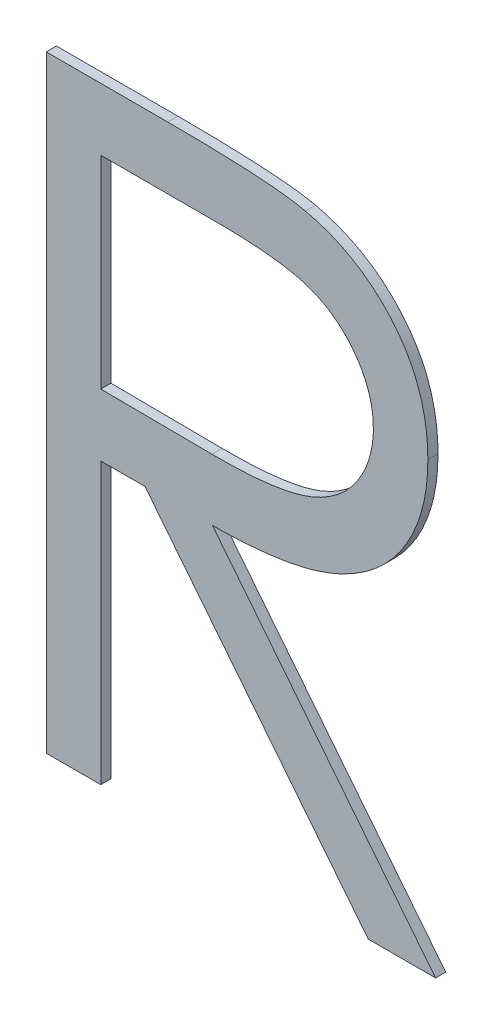
ISO-10303-21;
HEADER;
FILE_DESCRIPTION(('STEP AP214'),'2;1');
FILE_NAME('part.step','',(''),(''),'','','');
FILE_SCHEMA(('AUTOMOTIVE_DESIGN { 1 0 10303 214 1 1 1 1 }'));
ENDSEC;
DATA;
#1=APPLICATION_CONTEXT('core data for automotive mechanical design processes');
#2=APPLICATION_PROTOCOL_DEFINITION('international standard','automotive_design',2000,#1);
#3=PRODUCT_CONTEXT('',#1,'mechanical');
#4=PRODUCT('Part','Part','',(#3));
#5=PRODUCT_RELATED_PRODUCT_CATEGORY('part','',(#4));
#6=PRODUCT_DEFINITION_FORMATION('','',#4);
#7=PRODUCT_DEFINITION_CONTEXT('part definition',#1,'design');
#8=PRODUCT_DEFINITION('design','',#6,#7);
#9=PRODUCT_DEFINITION_SHAPE('','',#8);
#10=(LENGTH_UNIT() NAMED_UNIT(*) SI_UNIT(.MILLI.,.METRE.));
#11=(NAMED_UNIT(*) PLANE_ANGLE_UNIT() SI_UNIT($,.RADIAN.));
#12=(NAMED_UNIT(*) SI_UNIT($,.STERADIAN.) SOLID_ANGLE_UNIT());
#13=UNCERTAINTY_MEASURE_WITH_UNIT(LENGTH_MEASURE(1.E-05),#10,'distance_accuracy_value','');
#14=(GEOMETRIC_REPRESENTATION_CONTEXT(3) GLOBAL_UNCERTAINTY_ASSIGNED_CONTEXT((#13)) GLOBAL_UNIT_ASSIGNED_CONTEXT((#10,
#11,#12)) REPRESENTATION_CONTEXT('',''));
#15=CARTESIAN_POINT('',(0.,0.,0.));
#16=DIRECTION('',(0.,0.,1.));
#17=DIRECTION('',(1.,0.,0.));
#18=AXIS2_PLACEMENT_3D('',#15,#16,#17);
#19=CARTESIAN_POINT('',(1.04651695151315,0.249930146715529,0.551));
#20=DIRECTION('',(1.97743426691841E-13,1.87564335563237E-11,1.));
#21=DIRECTION('',(0.,-1.,1.87564335563237E-11));
#22=AXIS2_PLACEMENT_3D('',#19,#20,#21);
#23=PLANE('',#22);
#24=DIRECTION('',(0.,1.,0.));
#25=VECTOR('',#24,1.);
#26=CARTESIAN_POINT('',(1.02769230769231,0.190058603834586,0.551));
#27=LINE('',#26,#25);
#28=CARTESIAN_POINT('',(1.02769230769231,0.190058603834586,0.551));
#29=VERTEX_POINT('',#28);
#30=CARTESIAN_POINT('',(1.02769230769231,0.250058603834586,0.551));
#31=VERTEX_POINT('',#30);
#32=EDGE_CURVE('E11',#29,#31,#27,.T.);
#33=ORIENTED_EDGE('',*,*,#32,.F.);
#34=DIRECTION('',(-1.,0.,0.));
#35=VECTOR('',#34,1.);
#36=CARTESIAN_POINT('',(1.03307692307692,0.190058603834586,0.551));
#37=LINE('',#36,#35);
#38=CARTESIAN_POINT('',(1.03307692307692,0.190058603834586,0.551));
#39=VERTEX_POINT('',#38);
#40=EDGE_CURVE('E364',#39,#29,#37,.T.);
#41=ORIENTED_EDGE('',*,*,#40,.F.);
#42=DIRECTION('',(0.,-1.,0.));
#43=VECTOR('',#42,1.);
#44=CARTESIAN_POINT('',(1.03307692307692,0.217750911526894,0.551));
#45=LINE('',#44,#43);
#46=CARTESIAN_POINT('',(1.03307692307692,0.217750911526894,0.551));
#47=VERTEX_POINT('',#46);
#48=EDGE_CURVE('E354',#47,#39,#45,.T.);
#49=ORIENTED_EDGE('',*,*,#48,.F.);
#50=DIRECTION('',(-1.,0.,0.));
#51=VECTOR('',#50,1.);
#52=CARTESIAN_POINT('',(1.03745192307692,0.217750911526894,0.551));
#53=LINE('',#52,#51);
#54=CARTESIAN_POINT('',(1.03745192307692,0.217750911526894,0.551));
#55=VERTEX_POINT('',#54);
#56=EDGE_CURVE('E373',#55,#47,#53,.T.);
#57=ORIENTED_EDGE('',*,*,#56,.F.);
#58=DIRECTION('',(-0.622788232243942,0.782390450976023,0.));
#59=VECTOR('',#58,1.);
#60=CARTESIAN_POINT('',(1.05949519230769,0.190058603834586,0.551));
#61=LINE('',#60,#59);
#62=CARTESIAN_POINT('',(1.05949519230769,0.190058603834586,0.551));
#63=VERTEX_POINT('',#62);
#64=EDGE_CURVE('E309',#63,#55,#61,.T.);
#65=ORIENTED_EDGE('',*,*,#64,.F.);
#66=DIRECTION('',(-1.,0.,0.));
#67=VECTOR('',#66,1.);
#68=CARTESIAN_POINT('',(1.06615384615385,0.190058603834586,0.551));
#69=LINE('',#68,#67);
#70=CARTESIAN_POINT('',(1.06615384615385,0.190058603834586,0.551));
#71=VERTEX_POINT('',#70);
#72=EDGE_CURVE('E331',#71,#63,#69,.T.);
#73=ORIENTED_EDGE('',*,*,#72,.F.);
#74=DIRECTION('',(0.622788232243938,-0.782390450976027,0.));
#75=VECTOR('',#74,1.);
#76=CARTESIAN_POINT('',(1.04411057692308,0.217750911526894,0.551));
#77=LINE('',#76,#75);
#78=CARTESIAN_POINT('',(1.04411057692308,0.217750911526894,0.551));
#79=VERTEX_POINT('',#78);
#80=EDGE_CURVE('E403',#79,#71,#77,.T.);
#81=ORIENTED_EDGE('',*,*,#80,.F.);
#82=CARTESIAN_POINT('',(1.06538461538462,0.234012930757663,0.551000000000147));
#83=CARTESIAN_POINT('',(1.06539198862367,0.233208143029153,0.551000000000155));
#84=CARTESIAN_POINT('',(1.06534363416026,0.232399911940368,0.551000000000162));
#85=CARTESIAN_POINT('',(1.06504319058968,0.230127209417304,0.551000000000184));
#86=CARTESIAN_POINT('',(1.06465459933201,0.228678847628023,0.551000000000197));
#87=CARTESIAN_POINT('',(1.0634679187978,0.22595869306381,0.551000000000223));
#88=CARTESIAN_POINT('',(1.06267104904935,0.224686388699114,0.551000000000235));
#89=CARTESIAN_POINT('',(1.06077222715769,0.222531767884122,0.551000000000256));
#90=CARTESIAN_POINT('',(1.0596914140397,0.221630652988309,0.551000000000264));
#91=CARTESIAN_POINT('',(1.05732222913159,0.220139298122198,0.551000000000278));
#92=CARTESIAN_POINT('',(1.05603167277154,0.219552644845234,0.551000000000284));
#93=CARTESIAN_POINT('',(1.05349359496116,0.21872384228478,0.551000000000292));
#94=CARTESIAN_POINT('',(1.05225457052856,0.218453220566358,0.551000000000294));
#95=CARTESIAN_POINT('',(1.04961344985502,0.218030038474797,0.551000000000298));
#96=CARTESIAN_POINT('',(1.04820901466536,0.217894675771569,0.5510000000003));
#97=CARTESIAN_POINT('',(1.04590500181811,0.217774955225404,0.551000000000302));
#98=CARTESIAN_POINT('',(1.04500728977873,0.217753612277355,0.551000000000302));
#99=CARTESIAN_POINT('',(1.04411057692308,0.217750911526894,0.551000000000302));
#100=B_SPLINE_CURVE_WITH_KNOTS('',3,(#82,#83,#84,#85,#86,#87,#88,#89,#90,#91,#92,#93,#94,#95,
#96,#97,#98,#99),.UNSPECIFIED.,.F.,.F.,(4,2,2,2,2,2,2,2,4),(0.,0.00241891941124422,
0.00685955805685677,0.0112870091783176,0.0154491961450892,0.0196578972392595,0.0234477900413526,
0.0276743955237391,0.0303661860529401),.UNSPECIFIED.);
#101=CARTESIAN_POINT('',(1.06538461538462,0.234012930757663,0.551));
#102=VERTEX_POINT('',#101);
#103=EDGE_CURVE('E264',#102,#79,#100,.T.);
#104=ORIENTED_EDGE('',*,*,#103,.F.);
#105=CARTESIAN_POINT('',(1.05329326923077,0.249241296142279,0.551000000000006));
#106=CARTESIAN_POINT('',(1.05373769815676,0.249141816509165,0.551000000000007));
#107=CARTESIAN_POINT('',(1.05417934077213,0.249024335619531,0.551000000000008));
#108=CARTESIAN_POINT('',(1.05605684983316,0.248441927544629,0.551000000000013));
#109=CARTESIAN_POINT('',(1.0574439657625,0.247799194506053,0.551000000000019));
#110=CARTESIAN_POINT('',(1.05992797714477,0.246142282236047,0.551000000000035));
#111=CARTESIAN_POINT('',(1.06103078844518,0.245136941255299,0.551000000000044));
#112=CARTESIAN_POINT('',(1.06255069700614,0.243316636377108,0.55100000000006));
#113=CARTESIAN_POINT('',(1.06306701287537,0.242581925539827,0.551000000000067));
#114=CARTESIAN_POINT('',(1.06414305432734,0.240661178806734,0.551000000000085));
#115=CARTESIAN_POINT('',(1.06461213650458,0.239423710248342,0.551000000000096));
#116=CARTESIAN_POINT('',(1.06525086649367,0.236791112392058,0.551000000000121));
#117=CARTESIAN_POINT('',(1.06540066004284,0.235390973589226,0.551000000000134));
#118=CARTESIAN_POINT('',(1.06538461538462,0.234012930757663,0.551000000000147));
#119=B_SPLINE_CURVE_WITH_KNOTS('',3,(#105,#106,#107,#108,#109,#110,#111,#112,#113,#114,#115,
#116,#117,#118),.UNSPECIFIED.,.F.,.F.,(4,2,2,2,2,2,4),(0.,0.00136892634506286,
0.00588529537115449,0.0102982950077423,0.0129784776065293,0.0168999545398426,0.021058917792052),.UNSPECIFIED.);
#120=CARTESIAN_POINT('',(1.05329326923077,0.249241296142279,0.551));
#121=VERTEX_POINT('',#120);
#122=EDGE_CURVE('E132',#121,#102,#119,.T.);
#123=ORIENTED_EDGE('',*,*,#122,.F.);
#124=CARTESIAN_POINT('',(1.03969951923077,0.250058603834586,0.550999999999999));
#125=CARTESIAN_POINT('',(1.04050822202235,0.250061474272542,0.550999999999999));
#126=CARTESIAN_POINT('',(1.04131689366301,0.250057101550622,0.550999999999999));
#127=CARTESIAN_POINT('',(1.04345170633555,0.250028845168755,0.550999999999999));
#128=CARTESIAN_POINT('',(1.04477770951794,0.249994263254858,0.551));
#129=CARTESIAN_POINT('',(1.04656741325467,0.249930023446547,0.551));
#130=CARTESIAN_POINT('',(1.04703150147131,0.249911769882156,0.551));
#131=CARTESIAN_POINT('',(1.047896752522,0.249867137390711,0.551));
#132=CARTESIAN_POINT('',(1.048297993239,0.249842179452007,0.551000000000001));
#133=CARTESIAN_POINT('',(1.04939764221907,0.249767097745875,0.551000000000001));
#134=CARTESIAN_POINT('',(1.05009587131401,0.249712032679125,0.551000000000002));
#135=CARTESIAN_POINT('',(1.05163050701913,0.249543423776029,0.551000000000002));
#136=CARTESIAN_POINT('',(1.05246575263446,0.249420171128783,0.551000000000003));
#137=CARTESIAN_POINT('',(1.05329326931708,0.249241296124493,0.551000000000005));
#138=B_SPLINE_CURVE_WITH_KNOTS('',3,(#124,#125,#126,#127,#128,#129,#130,#131,#132,#133,#134,
#135,#136,#137),.UNSPECIFIED.,.F.,.F.,(4,2,2,2,2,2,4),(0.,0.0024259952125814,
0.00640503198262989,0.00779828294297926,0.00900436448881874,0.0111044226708496,
0.0136370297981723),.UNSPECIFIED.);
#139=CARTESIAN_POINT('',(1.03969951923077,0.250058603834586,0.551));
#140=VERTEX_POINT('',#139);
#141=EDGE_CURVE('E125',#140,#121,#138,.T.);
#142=ORIENTED_EDGE('',*,*,#141,.F.);
#143=DIRECTION('',(1.,0.,0.));
#144=VECTOR('',#143,1.);
#145=CARTESIAN_POINT('',(1.02769230769231,0.250058603834586,0.551));
#146=LINE('',#145,#144);
#147=EDGE_CURVE('E129',#31,#140,#146,.T.);
#148=ORIENTED_EDGE('',*,*,#147,.F.);
#149=EDGE_LOOP('',(#33,#41,#49,#57,#65,#73,#81,#104,#123,#142,#148));
#150=FACE_BOUND('',#149,.T.);
#151=DIRECTION('',(0.,-1.,0.));
#152=VECTOR('',#151,1.);
#153=CARTESIAN_POINT('',(1.03307692307692,0.24390475768074,0.551));
#154=LINE('',#153,#152);
#155=CARTESIAN_POINT('',(1.03307692307692,0.24390475768074,0.551));
#156=VERTEX_POINT('',#155);
#157=CARTESIAN_POINT('',(1.03307692307692,0.22390475768074,0.551));
#158=VERTEX_POINT('',#157);
#159=EDGE_CURVE('E356',#156,#158,#154,.T.);
#160=ORIENTED_EDGE('',*,*,#159,.F.);
#161=DIRECTION('',(-1.,0.,0.));
#162=VECTOR('',#161,1.);
#163=CARTESIAN_POINT('',(1.04432692307692,0.24390475768074,0.551));
#164=LINE('',#163,#162);
#165=CARTESIAN_POINT('',(1.04432692307692,0.24390475768074,0.551));
#166=VERTEX_POINT('',#165);
#167=EDGE_CURVE('E350',#166,#156,#164,.T.);
#168=ORIENTED_EDGE('',*,*,#167,.F.);
#169=CARTESIAN_POINT('',(1.06,0.234024949988432,0.551000000000148));
#170=CARTESIAN_POINT('',(1.06000392428741,0.234511612914194,0.551000000000143));
#171=CARTESIAN_POINT('',(1.05996659464831,0.234999359162641,0.551000000000138));
#172=CARTESIAN_POINT('',(1.05976624334217,0.236257419105929,0.551000000000127));
#173=CARTESIAN_POINT('',(1.05954041264546,0.237018502244953,0.55100000000012));
#174=CARTESIAN_POINT('',(1.05889544699971,0.23846242663933,0.551000000000106));
#175=CARTESIAN_POINT('',(1.05847385882739,0.239144133395163,0.5510000000001));
#176=CARTESIAN_POINT('',(1.05738020991851,0.240526408229965,0.551000000000087));
#177=CARTESIAN_POINT('',(1.0566740922794,0.24120069180154,0.551000000000081));
#178=CARTESIAN_POINT('',(1.05510993694711,0.242273630921482,0.551000000000071));
#179=CARTESIAN_POINT('',(1.05425765196745,0.242680613393515,0.551000000000067));
#180=CARTESIAN_POINT('',(1.05246692887223,0.243264518902941,0.551000000000061));
#181=CARTESIAN_POINT('',(1.05152700077418,0.24343614726552,0.55100000000006));
#182=CARTESIAN_POINT('',(1.04951044237811,0.243708053945155,0.551000000000058));
#183=CARTESIAN_POINT('',(1.04843276270767,0.243795299526175,0.551000000000057));
#184=CARTESIAN_POINT('',(1.04634537057945,0.243892071044446,0.551000000000057));
#185=CARTESIAN_POINT('',(1.0453359092012,0.24390638401215,0.551000000000057));
#186=CARTESIAN_POINT('',(1.04432692307692,0.24390475768074,0.551000000000057));
#187=B_SPLINE_CURVE_WITH_KNOTS('',3,(#169,#170,#171,#172,#173,#174,#175,#176,#177,#178,#179,
#180,#181,#182,#183,#184,#185,#186),.UNSPECIFIED.,.F.,.F.,(4,2,2,2,2,2,2,2,4),(0.,
0.00146052189542997,0.00381245881078419,0.00619470032203898,0.00907883187438904,
0.011868217489994,0.0147193788174967,0.0179620276670236,0.0209888198468922),.UNSPECIFIED.);
#188=CARTESIAN_POINT('',(1.06,0.234024949988432,0.551000000000295));
#189=VERTEX_POINT('',#188);
#190=EDGE_CURVE('E345',#189,#166,#187,.T.);
#191=ORIENTED_EDGE('',*,*,#190,.F.);
#192=CARTESIAN_POINT('',(1.0440625,0.223820623065356,0.551000000000245));
#193=CARTESIAN_POINT('',(1.04457973628467,0.223820500130313,0.551000000000245));
#194=CARTESIAN_POINT('',(1.04509755001538,0.22382356010618,0.551000000000245));
#195=CARTESIAN_POINT('',(1.04733515548862,0.22386433604423,0.551000000000245));
#196=CARTESIAN_POINT('',(1.04905522355523,0.223966004860116,0.551000000000243));
#197=CARTESIAN_POINT('',(1.0519866399899,0.22446424341334,0.551000000000238));
#198=CARTESIAN_POINT('',(1.0532074239547,0.224771721081369,0.551000000000235));
#199=CARTESIAN_POINT('',(1.05529383403587,0.225713816948195,0.551000000000226));
#200=CARTESIAN_POINT('',(1.0561847745416,0.226285640795416,0.55100000000022));
#201=CARTESIAN_POINT('',(1.05755704627893,0.227546913128129,0.55100000000021));
#202=CARTESIAN_POINT('',(1.05808511184673,0.228186373288065,0.551000000000205));
#203=CARTESIAN_POINT('',(1.05896885000218,0.229586099894732,0.551000000000187));
#204=CARTESIAN_POINT('',(1.05932222846021,0.230347808443949,0.551000000000172));
#205=CARTESIAN_POINT('',(1.05986343487623,0.232071540001431,0.551000000000179));
#206=CARTESIAN_POINT('',(1.06001296559428,0.233045615172946,0.551000000000207));
#207=CARTESIAN_POINT('',(1.06,0.234024949988433,0.551000000000296));
#208=B_SPLINE_CURVE_WITH_KNOTS('',3,(#192,#193,#194,#195,#196,#197,#198,#199,#200,#201,#202,
#203,#204,#205,#206,#207),.UNSPECIFIED.,.F.,.F.,(4,2,2,2,2,2,2,4),(0.,0.00155294059489266,
0.00671029616850972,0.0104448873224632,0.0135593956664783,0.016019250547349,0.0185106045531839,
0.0214249742693327),.UNSPECIFIED.);
#209=CARTESIAN_POINT('',(1.0440625,0.223820623065356,0.551));
#210=VERTEX_POINT('',#209);
#211=EDGE_CURVE('E302',#210,#189,#208,.T.);
#212=ORIENTED_EDGE('',*,*,#211,.F.);
#213=DIRECTION('',(0.999970673881285,-0.00765841872775626,0.));
#214=VECTOR('',#213,1.);
#215=CARTESIAN_POINT('',(1.03307692307692,0.22390475768074,0.551));
#216=LINE('',#215,#214);
#217=EDGE_CURVE('E332',#158,#210,#216,.T.);
#218=ORIENTED_EDGE('',*,*,#217,.F.);
#219=EDGE_LOOP('',(#160,#168,#191,#212,#218));
#220=FACE_BOUND('',#219,.T.);
#221=ADVANCED_FACE('F17',(#150,#220),#23,.T.);
#222=CARTESIAN_POINT('',(1.04651695151315,0.249930146715529,0.55));
#223=DIRECTION('',(1.97743426691841E-13,1.87564335563237E-11,1.));
#224=DIRECTION('',(0.,-1.,1.87564335563237E-11));
#225=AXIS2_PLACEMENT_3D('',#222,#223,#224);
#226=PLANE('',#225);
#227=DIRECTION('',(0.,1.,0.));
#228=VECTOR('',#227,1.);
#229=CARTESIAN_POINT('',(1.02769230769231,0.190058603834586,0.55));
#230=LINE('',#229,#228);
#231=CARTESIAN_POINT('',(1.02769230769231,0.190058603834586,0.55));
#232=VERTEX_POINT('',#231);
#233=CARTESIAN_POINT('',(1.02769230769231,0.250058603834586,0.55));
#234=VERTEX_POINT('',#233);
#235=EDGE_CURVE('E25',#232,#234,#230,.T.);
#236=ORIENTED_EDGE('',*,*,#235,.T.);
#237=DIRECTION('',(1.,0.,0.));
#238=VECTOR('',#237,1.);
#239=CARTESIAN_POINT('',(1.02769230769231,0.250058603834586,0.55));
#240=LINE('',#239,#238);
#241=CARTESIAN_POINT('',(1.03969951923077,0.250058603834586,0.55));
#242=VERTEX_POINT('',#241);
#243=EDGE_CURVE('E353',#234,#242,#240,.T.);
#244=ORIENTED_EDGE('',*,*,#243,.T.);
#245=CARTESIAN_POINT('',(1.03969951923077,0.250058603834586,0.549999999999999));
#246=CARTESIAN_POINT('',(1.04050822202258,0.250061474275804,0.549999999999999));
#247=CARTESIAN_POINT('',(1.04131689366316,0.250057101552648,0.549999999999999));
#248=CARTESIAN_POINT('',(1.04345170633532,0.250028845165431,0.549999999999999));
#249=CARTESIAN_POINT('',(1.04477770951731,0.249994263246084,0.55));
#250=CARTESIAN_POINT('',(1.04656741404555,0.24993002342124,0.55));
#251=CARTESIAN_POINT('',(1.04703150305301,0.249911769827855,0.55));
#252=CARTESIAN_POINT('',(1.04789675568168,0.249867137217123,0.55));
#253=CARTESIAN_POINT('',(1.04829799718619,0.249842179193903,0.550000000000001));
#254=CARTESIAN_POINT('',(1.04939764537069,0.249767097448336,0.550000000000002));
#255=CARTESIAN_POINT('',(1.05009587288402,0.249712032482048,0.550000000000002));
#256=CARTESIAN_POINT('',(1.05163050702198,0.249543423805361,0.550000000000002));
#257=CARTESIAN_POINT('',(1.05246575264023,0.249420171187482,0.550000000000003));
#258=CARTESIAN_POINT('',(1.05329326931708,0.249241296124493,0.550000000000006));
#259=B_SPLINE_CURVE_WITH_KNOTS('',3,(#245,#246,#247,#248,#249,#250,#251,#252,#253,#254,#255,
#256,#257,#258),.UNSPECIFIED.,.F.,.F.,(4,2,2,2,2,2,4),(0.,0.0024259952125814,
0.00640503198262989,0.00779828531636374,0.0090043692355199,0.0111044226709795,
0.0136370297983022),.UNSPECIFIED.);
#260=CARTESIAN_POINT('',(1.05329326923077,0.249241296142279,0.55));
#261=VERTEX_POINT('',#260);
#262=EDGE_CURVE('E143',#242,#261,#259,.T.);
#263=ORIENTED_EDGE('',*,*,#262,.T.);
#264=CARTESIAN_POINT('',(1.05329326923077,0.249241296142279,0.550000000000006));
#265=CARTESIAN_POINT('',(1.05373769815676,0.249141816509165,0.550000000000007));
#266=CARTESIAN_POINT('',(1.05417934077213,0.249024335619531,0.550000000000008));
#267=CARTESIAN_POINT('',(1.05605684983316,0.248441927544629,0.550000000000013));
#268=CARTESIAN_POINT('',(1.0574439657625,0.247799194506053,0.550000000000018));
#269=CARTESIAN_POINT('',(1.05992797714477,0.246142282236047,0.550000000000034));
#270=CARTESIAN_POINT('',(1.06103078844518,0.245136941255299,0.550000000000044));
#271=CARTESIAN_POINT('',(1.06255069700614,0.243316636377108,0.55000000000006));
#272=CARTESIAN_POINT('',(1.06306701287537,0.242581925539827,0.550000000000067));
#273=CARTESIAN_POINT('',(1.06414305432734,0.240661178806734,0.550000000000085));
#274=CARTESIAN_POINT('',(1.06461213650458,0.239423710248342,0.550000000000097));
#275=CARTESIAN_POINT('',(1.06525086649367,0.236791112392058,0.550000000000122));
#276=CARTESIAN_POINT('',(1.06540066004284,0.235390973589226,0.550000000000135));
#277=CARTESIAN_POINT('',(1.06538461538462,0.234012930757663,0.550000000000147));
#278=B_SPLINE_CURVE_WITH_KNOTS('',3,(#264,#265,#266,#267,#268,#269,#270,#271,#272,#273,#274,
#275,#276,#277),.UNSPECIFIED.,.F.,.F.,(4,2,2,2,2,2,4),(0.,0.00136892634506286,
0.00588529537115449,0.0102982950077423,0.0129784776065293,0.0168999545398426,0.021058917792052),.UNSPECIFIED.);
#279=CARTESIAN_POINT('',(1.06538461538462,0.234012930757663,0.55));
#280=VERTEX_POINT('',#279);
#281=EDGE_CURVE('E225',#261,#280,#278,.T.);
#282=ORIENTED_EDGE('',*,*,#281,.T.);
#283=CARTESIAN_POINT('',(1.06538461538462,0.234012930757663,0.550000000000147));
#284=CARTESIAN_POINT('',(1.06539198862367,0.233208143029153,0.550000000000155));
#285=CARTESIAN_POINT('',(1.06534363416026,0.232399911940368,0.550000000000162));
#286=CARTESIAN_POINT('',(1.06504319058968,0.230127209417304,0.550000000000184));
#287=CARTESIAN_POINT('',(1.06465459933201,0.228678847628023,0.550000000000197));
#288=CARTESIAN_POINT('',(1.0634679187978,0.22595869306381,0.550000000000223));
#289=CARTESIAN_POINT('',(1.06267104904935,0.224686388699114,0.550000000000234));
#290=CARTESIAN_POINT('',(1.06077222715769,0.222531767884122,0.550000000000255));
#291=CARTESIAN_POINT('',(1.0596914140397,0.221630652988309,0.550000000000264));
#292=CARTESIAN_POINT('',(1.05732222913159,0.220139298122198,0.550000000000278));
#293=CARTESIAN_POINT('',(1.05603167277154,0.219552644845234,0.550000000000284));
#294=CARTESIAN_POINT('',(1.05349359496116,0.21872384228478,0.550000000000292));
#295=CARTESIAN_POINT('',(1.05225457052856,0.218453220566358,0.550000000000294));
#296=CARTESIAN_POINT('',(1.04961344985502,0.218030038474797,0.550000000000298));
#297=CARTESIAN_POINT('',(1.04820901466536,0.217894675771569,0.5500000000003));
#298=CARTESIAN_POINT('',(1.04590500181811,0.217774955225404,0.550000000000302));
#299=CARTESIAN_POINT('',(1.04500728977873,0.217753612277355,0.550000000000302));
#300=CARTESIAN_POINT('',(1.04411057692308,0.217750911526894,0.550000000000302));
#301=B_SPLINE_CURVE_WITH_KNOTS('',3,(#283,#284,#285,#286,#287,#288,#289,#290,#291,#292,#293,
#294,#295,#296,#297,#298,#299,#300),.UNSPECIFIED.,.F.,.F.,(4,2,2,2,2,2,2,2,4),(0.,
0.00241891941124422,0.00685955805685677,0.0112870091783176,0.0154491961450892,
0.0196578972392595,0.0234477900413526,0.0276743955237391,0.0303661860529401),.UNSPECIFIED.);
#302=CARTESIAN_POINT('',(1.04411057692308,0.217750911526894,0.55));
#303=VERTEX_POINT('',#302);
#304=EDGE_CURVE('E217',#280,#303,#301,.T.);
#305=ORIENTED_EDGE('',*,*,#304,.T.);
#306=DIRECTION('',(0.622788232243938,-0.782390450976027,0.));
#307=VECTOR('',#306,1.);
#308=CARTESIAN_POINT('',(1.04411057692308,0.217750911526894,0.55));
#309=LINE('',#308,#307);
#310=CARTESIAN_POINT('',(1.06615384615385,0.190058603834586,0.55));
#311=VERTEX_POINT('',#310);
#312=EDGE_CURVE('E396',#303,#311,#309,.T.);
#313=ORIENTED_EDGE('',*,*,#312,.T.);
#314=DIRECTION('',(-1.,0.,0.));
#315=VECTOR('',#314,1.);
#316=CARTESIAN_POINT('',(1.06615384615385,0.190058603834586,0.55));
#317=LINE('',#316,#315);
#318=CARTESIAN_POINT('',(1.05949519230769,0.190058603834586,0.55));
#319=VERTEX_POINT('',#318);
#320=EDGE_CURVE('E393',#311,#319,#317,.T.);
#321=ORIENTED_EDGE('',*,*,#320,.T.);
#322=DIRECTION('',(-0.622788232243942,0.782390450976023,0.));
#323=VECTOR('',#322,1.);
#324=CARTESIAN_POINT('',(1.05949519230769,0.190058603834586,0.55));
#325=LINE('',#324,#323);
#326=CARTESIAN_POINT('',(1.03745192307692,0.217750911526894,0.55));
#327=VERTEX_POINT('',#326);
#328=EDGE_CURVE('E391',#319,#327,#325,.T.);
#329=ORIENTED_EDGE('',*,*,#328,.T.);
#330=DIRECTION('',(-1.,0.,0.));
#331=VECTOR('',#330,1.);
#332=CARTESIAN_POINT('',(1.03745192307692,0.217750911526894,0.55));
#333=LINE('',#332,#331);
#334=CARTESIAN_POINT('',(1.03307692307692,0.217750911526894,0.55));
#335=VERTEX_POINT('',#334);
#336=EDGE_CURVE('E310',#327,#335,#333,.T.);
#337=ORIENTED_EDGE('',*,*,#336,.T.);
#338=DIRECTION('',(0.,-1.,0.));
#339=VECTOR('',#338,1.);
#340=CARTESIAN_POINT('',(1.03307692307692,0.217750911526894,0.55));
#341=LINE('',#340,#339);
#342=CARTESIAN_POINT('',(1.03307692307692,0.190058603834586,0.55));
#343=VERTEX_POINT('',#342);
#344=EDGE_CURVE('E379',#335,#343,#341,.T.);
#345=ORIENTED_EDGE('',*,*,#344,.T.);
#346=DIRECTION('',(-1.,0.,0.));
#347=VECTOR('',#346,1.);
#348=CARTESIAN_POINT('',(1.03307692307692,0.190058603834586,0.55));
#349=LINE('',#348,#347);
#350=EDGE_CURVE('E388',#343,#232,#349,.T.);
#351=ORIENTED_EDGE('',*,*,#350,.T.);
#352=EDGE_LOOP('',(#236,#244,#263,#282,#305,#313,#321,#329,#337,#345,#351));
#353=FACE_BOUND('',#352,.T.);
#354=DIRECTION('',(-1.,0.,0.));
#355=VECTOR('',#354,1.);
#356=CARTESIAN_POINT('',(1.04432692307692,0.24390475768074,0.55));
#357=LINE('',#356,#355);
#358=CARTESIAN_POINT('',(1.04432692307692,0.24390475768074,0.550000000000113));
#359=VERTEX_POINT('',#358);
#360=CARTESIAN_POINT('',(1.03307692307692,0.24390475768074,0.55));
#361=VERTEX_POINT('',#360);
#362=EDGE_CURVE('E351',#359,#361,#357,.T.);
#363=ORIENTED_EDGE('',*,*,#362,.T.);
#364=DIRECTION('',(0.,-1.,0.));
#365=VECTOR('',#364,1.);
#366=CARTESIAN_POINT('',(1.03307692307692,0.24390475768074,0.55));
#367=LINE('',#366,#365);
#368=CARTESIAN_POINT('',(1.03307692307692,0.22390475768074,0.55));
#369=VERTEX_POINT('',#368);
#370=EDGE_CURVE('E187',#361,#369,#367,.T.);
#371=ORIENTED_EDGE('',*,*,#370,.T.);
#372=DIRECTION('',(0.999970673881285,-0.00765841872775626,0.));
#373=VECTOR('',#372,1.);
#374=CARTESIAN_POINT('',(1.03307692307692,0.22390475768074,0.55));
#375=LINE('',#374,#373);
#376=CARTESIAN_POINT('',(1.0440625,0.223820623065356,0.55));
#377=VERTEX_POINT('',#376);
#378=EDGE_CURVE('E234',#369,#377,#375,.T.);
#379=ORIENTED_EDGE('',*,*,#378,.T.);
#380=CARTESIAN_POINT('',(1.0440625,0.223820623065356,0.550000000000245));
#381=CARTESIAN_POINT('',(1.04457973628467,0.223820500130313,0.550000000000245));
#382=CARTESIAN_POINT('',(1.04509755001538,0.22382356010618,0.550000000000245));
#383=CARTESIAN_POINT('',(1.04733515548862,0.22386433604423,0.550000000000245));
#384=CARTESIAN_POINT('',(1.04905522355523,0.223966004860116,0.550000000000243));
#385=CARTESIAN_POINT('',(1.0519866399899,0.22446424341334,0.550000000000238));
#386=CARTESIAN_POINT('',(1.0532074239547,0.224771721081369,0.550000000000235));
#387=CARTESIAN_POINT('',(1.05529383403587,0.225713816948196,0.550000000000226));
#388=CARTESIAN_POINT('',(1.0561847745416,0.226285640795417,0.550000000000221));
#389=CARTESIAN_POINT('',(1.05755704627893,0.227546913128129,0.550000000000209));
#390=CARTESIAN_POINT('',(1.05808511184673,0.228186373288066,0.550000000000203));
#391=CARTESIAN_POINT('',(1.05896885000218,0.229586099894732,0.550000000000189));
#392=CARTESIAN_POINT('',(1.05932222846021,0.230347808443949,0.550000000000182));
#393=CARTESIAN_POINT('',(1.05986343487623,0.232071540001432,0.550000000000166));
#394=CARTESIAN_POINT('',(1.06001296559428,0.233045615172946,0.550000000000157));
#395=CARTESIAN_POINT('',(1.06,0.234024949988433,0.550000000000148));
#396=B_SPLINE_CURVE_WITH_KNOTS('',3,(#380,#381,#382,#383,#384,#385,#386,#387,#388,#389,#390,
#391,#392,#393,#394,#395),.UNSPECIFIED.,.F.,.F.,(4,2,2,2,2,2,2,4),(0.,0.00155294059489266,
0.00671029616850972,0.0104448873224632,0.0135593956664788,0.0160192505473488,0.0185106045531846,
0.0214249742693324),.UNSPECIFIED.);
#397=CARTESIAN_POINT('',(1.06,0.234024949988432,0.55));
#398=VERTEX_POINT('',#397);
#399=EDGE_CURVE('E209',#377,#398,#396,.T.);
#400=ORIENTED_EDGE('',*,*,#399,.T.);
#401=CARTESIAN_POINT('',(1.06,0.234024949988432,0.550000000000148));
#402=CARTESIAN_POINT('',(1.06000392428741,0.234511612914194,0.550000000000143));
#403=CARTESIAN_POINT('',(1.05996659464831,0.234999359162641,0.550000000000139));
#404=CARTESIAN_POINT('',(1.05976624334217,0.236257419105929,0.550000000000127));
#405=CARTESIAN_POINT('',(1.05954041264546,0.237018502244953,0.55000000000012));
#406=CARTESIAN_POINT('',(1.05889544699971,0.23846242663933,0.550000000000106));
#407=CARTESIAN_POINT('',(1.05847385882739,0.239144133395163,0.5500000000001));
#408=CARTESIAN_POINT('',(1.05738020991851,0.240526408229965,0.550000000000087));
#409=CARTESIAN_POINT('',(1.0566740922794,0.24120069180154,0.550000000000081));
#410=CARTESIAN_POINT('',(1.05510993694711,0.242273630921482,0.550000000000071));
#411=CARTESIAN_POINT('',(1.05425765196745,0.242680613393515,0.550000000000067));
#412=CARTESIAN_POINT('',(1.05246692887223,0.243264518902941,0.550000000000061));
#413=CARTESIAN_POINT('',(1.05152700077418,0.24343614726552,0.55000000000006));
#414=CARTESIAN_POINT('',(1.04951044237811,0.243708053945155,0.550000000000058));
#415=CARTESIAN_POINT('',(1.04843276270767,0.243795299526175,0.550000000000057));
#416=CARTESIAN_POINT('',(1.04634537057945,0.243892071044446,0.550000000000057));
#417=CARTESIAN_POINT('',(1.0453359092012,0.24390638401215,0.550000000000057));
#418=CARTESIAN_POINT('',(1.04432692307692,0.24390475768074,0.550000000000057));
#419=B_SPLINE_CURVE_WITH_KNOTS('',3,(#401,#402,#403,#404,#405,#406,#407,#408,#409,#410,#411,
#412,#413,#414,#415,#416,#417,#418),.UNSPECIFIED.,.F.,.F.,(4,2,2,2,2,2,2,2,4),(0.,
0.00146052189542997,0.00381245881078419,0.00619470032203898,0.00907883187438904,
0.011868217489994,0.0147193788174967,0.0179620276670236,0.0209888198468922),.UNSPECIFIED.);
#420=EDGE_CURVE('E199',#398,#359,#419,.T.);
#421=ORIENTED_EDGE('',*,*,#420,.T.);
#422=EDGE_LOOP('',(#363,#371,#379,#400,#421));
#423=FACE_BOUND('',#422,.T.);
#424=ADVANCED_FACE('F190',(#353,#423),#226,.F.);
#425=CARTESIAN_POINT('',(1.02769230769231,0.190058603834586,0.551));
#426=DIRECTION('',(-1.,0.,0.));
#427=DIRECTION('',(0.,0.,1.));
#428=AXIS2_PLACEMENT_3D('',#425,#426,#427);
#429=PLANE('',#428);
#430=ORIENTED_EDGE('',*,*,#235,.F.);
#431=DIRECTION('',(0.,0.,-1.));
#432=VECTOR('',#431,1.);
#433=CARTESIAN_POINT('',(1.02769230769231,0.190058603834586,0.551));
#434=LINE('',#433,#432);
#435=EDGE_CURVE('E186',#29,#232,#434,.T.);
#436=ORIENTED_EDGE('',*,*,#435,.F.);
#437=ORIENTED_EDGE('',*,*,#32,.T.);
#438=DIRECTION('',(0.,0.,-1.));
#439=VECTOR('',#438,1.);
#440=CARTESIAN_POINT('',(1.02769230769231,0.250058603834586,0.551));
#441=LINE('',#440,#439);
#442=EDGE_CURVE('E150',#31,#234,#441,.T.);
#443=ORIENTED_EDGE('',*,*,#442,.T.);
#444=EDGE_LOOP('',(#430,#436,#437,#443));
#445=FACE_BOUND('',#444,.T.);
#446=ADVANCED_FACE('F194',(#445),#429,.T.);
#447=CARTESIAN_POINT('',(1.03307692307692,0.190058603834586,0.551));
#448=DIRECTION('',(0.,-1.,0.));
#449=DIRECTION('',(0.,0.,-1.));
#450=AXIS2_PLACEMENT_3D('',#447,#448,#449);
#451=PLANE('',#450);
#452=ORIENTED_EDGE('',*,*,#350,.F.);
#453=DIRECTION('',(0.,0.,-1.));
#454=VECTOR('',#453,1.);
#455=CARTESIAN_POINT('',(1.03307692307692,0.190058603834586,0.551));
#456=LINE('',#455,#454);
#457=EDGE_CURVE('E233',#39,#343,#456,.T.);
#458=ORIENTED_EDGE('',*,*,#457,.F.);
#459=ORIENTED_EDGE('',*,*,#40,.T.);
#460=ORIENTED_EDGE('',*,*,#435,.T.);
#461=EDGE_LOOP('',(#452,#458,#459,#460));
#462=FACE_BOUND('',#461,.T.);
#463=ADVANCED_FACE('F369',(#462),#451,.T.);
#464=CARTESIAN_POINT('',(1.03307692307692,0.217750911526894,0.551));
#465=DIRECTION('',(1.,0.,0.));
#466=DIRECTION('',(0.,0.,-1.));
#467=AXIS2_PLACEMENT_3D('',#464,#465,#466);
#468=PLANE('',#467);
#469=ORIENTED_EDGE('',*,*,#344,.F.);
#470=DIRECTION('',(0.,0.,-1.));
#471=VECTOR('',#470,1.);
#472=CARTESIAN_POINT('',(1.03307692307692,0.217750911526894,0.551));
#473=LINE('',#472,#471);
#474=EDGE_CURVE('E377',#47,#335,#473,.T.);
#475=ORIENTED_EDGE('',*,*,#474,.F.);
#476=ORIENTED_EDGE('',*,*,#48,.T.);
#477=ORIENTED_EDGE('',*,*,#457,.T.);
#478=EDGE_LOOP('',(#469,#475,#476,#477));
#479=FACE_BOUND('',#478,.T.);
#480=ADVANCED_FACE('F171',(#479),#468,.T.);
#481=CARTESIAN_POINT('',(1.03745192307692,0.217750911526894,0.551));
#482=DIRECTION('',(0.,-1.,0.));
#483=DIRECTION('',(0.,0.,-1.));
#484=AXIS2_PLACEMENT_3D('',#481,#482,#483);
#485=PLANE('',#484);
#486=ORIENTED_EDGE('',*,*,#336,.F.);
#487=DIRECTION('',(0.,0.,-1.));
#488=VECTOR('',#487,1.);
#489=CARTESIAN_POINT('',(1.03745192307692,0.217750911526894,0.551));
#490=LINE('',#489,#488);
#491=EDGE_CURVE('E382',#55,#327,#490,.T.);
#492=ORIENTED_EDGE('',*,*,#491,.F.);
#493=ORIENTED_EDGE('',*,*,#56,.T.);
#494=ORIENTED_EDGE('',*,*,#474,.T.);
#495=EDGE_LOOP('',(#486,#492,#493,#494));
#496=FACE_BOUND('',#495,.T.);
#497=ADVANCED_FACE('F169',(#496),#485,.T.);
#498=CARTESIAN_POINT('',(1.05949519230769,0.190058603834586,0.551));
#499=DIRECTION('',(-0.782390450976024,-0.622788232243941,0.));
#500=DIRECTION('',(0.622788232243941,-0.782390450976024,0.));
#501=AXIS2_PLACEMENT_3D('',#498,#499,#500);
#502=PLANE('',#501);
#503=ORIENTED_EDGE('',*,*,#328,.F.);
#504=DIRECTION('',(0.,0.,-1.));
#505=VECTOR('',#504,1.);
#506=CARTESIAN_POINT('',(1.05949519230769,0.190058603834586,0.551));
#507=LINE('',#506,#505);
#508=EDGE_CURVE('E271',#63,#319,#507,.T.);
#509=ORIENTED_EDGE('',*,*,#508,.F.);
#510=ORIENTED_EDGE('',*,*,#64,.T.);
#511=ORIENTED_EDGE('',*,*,#491,.T.);
#512=EDGE_LOOP('',(#503,#509,#510,#511));
#513=FACE_BOUND('',#512,.T.);
#514=ADVANCED_FACE('F294',(#513),#502,.T.);
#515=CARTESIAN_POINT('',(1.06615384615385,0.190058603834586,0.551));
#516=DIRECTION('',(0.,-1.,0.));
#517=DIRECTION('',(0.,0.,-1.));
#518=AXIS2_PLACEMENT_3D('',#515,#516,#517);
#519=PLANE('',#518);
#520=ORIENTED_EDGE('',*,*,#320,.F.);
#521=DIRECTION('',(0.,0.,-1.));
#522=VECTOR('',#521,1.);
#523=CARTESIAN_POINT('',(1.06615384615385,0.190058603834586,0.551));
#524=LINE('',#523,#522);
#525=EDGE_CURVE('E261',#71,#311,#524,.T.);
#526=ORIENTED_EDGE('',*,*,#525,.F.);
#527=ORIENTED_EDGE('',*,*,#72,.T.);
#528=ORIENTED_EDGE('',*,*,#508,.T.);
#529=EDGE_LOOP('',(#520,#526,#527,#528));
#530=FACE_BOUND('',#529,.T.);
#531=ADVANCED_FACE('F280',(#530),#519,.T.);
#532=CARTESIAN_POINT('',(1.04411057692308,0.217750911526894,0.551));
#533=DIRECTION('',(0.782390450976027,0.622788232243938,0.));
#534=DIRECTION('',(-0.622788232243938,0.782390450976027,0.));
#535=AXIS2_PLACEMENT_3D('',#532,#533,#534);
#536=PLANE('',#535);
#537=ORIENTED_EDGE('',*,*,#312,.F.);
#538=DIRECTION('',(0.,0.,-1.));
#539=VECTOR('',#538,1.);
#540=CARTESIAN_POINT('',(1.04411057692308,0.217750911526894,0.551));
#541=LINE('',#540,#539);
#542=EDGE_CURVE('E136',#79,#303,#541,.T.);
#543=ORIENTED_EDGE('',*,*,#542,.F.);
#544=ORIENTED_EDGE('',*,*,#80,.T.);
#545=ORIENTED_EDGE('',*,*,#525,.T.);
#546=EDGE_LOOP('',(#537,#543,#544,#545));
#547=FACE_BOUND('',#546,.T.);
#548=ADVANCED_FACE('F278',(#547),#536,.T.);
#549=CARTESIAN_POINT('',(1.06538461538462,0.234012930757663,0.551));
#550=CARTESIAN_POINT('',(1.06538461538462,0.234012930757663,0.55));
#551=CARTESIAN_POINT('',(1.0653594325599,0.233213471821476,0.551));
#552=CARTESIAN_POINT('',(1.0653594325599,0.233213471821476,0.55));
#553=CARTESIAN_POINT('',(1.06531029434636,0.231653520371966,0.551));
#554=CARTESIAN_POINT('',(1.06531029434636,0.231653520371966,0.55));
#555=CARTESIAN_POINT('',(1.06485214971185,0.229389619547816,0.551));
#556=CARTESIAN_POINT('',(1.06485214971185,0.229389619547816,0.55));
#557=CARTESIAN_POINT('',(1.06410169508793,0.227277802725408,0.551));
#558=CARTESIAN_POINT('',(1.06410169508793,0.227277802725408,0.55));
#559=CARTESIAN_POINT('',(1.06306758156205,0.225320728932572,0.551));
#560=CARTESIAN_POINT('',(1.06306758156205,0.225320728932572,0.55));
#561=CARTESIAN_POINT('',(1.06175067626411,0.223556546440684,0.551));
#562=CARTESIAN_POINT('',(1.06175067626411,0.223556546440684,0.55));
#563=CARTESIAN_POINT('',(1.06016796555948,0.222006995778331,0.551));
#564=CARTESIAN_POINT('',(1.06016796555948,0.222006995778331,0.55));
#565=CARTESIAN_POINT('',(1.05831856650537,0.220710311562489,0.551));
#566=CARTESIAN_POINT('',(1.05831856650537,0.220710311562489,0.55));
#567=CARTESIAN_POINT('',(1.05659692108927,0.219811120624749,0.551));
#568=CARTESIAN_POINT('',(1.05659692108927,0.219811120624749,0.55));
#569=CARTESIAN_POINT('',(1.05507610623733,0.219235242191181,0.551));
#570=CARTESIAN_POINT('',(1.05507610623733,0.219235242191181,0.55));
#571=CARTESIAN_POINT('',(1.05382410658953,0.218830047467884,0.551));
#572=CARTESIAN_POINT('',(1.05382410658953,0.218830047467884,0.55));
#573=CARTESIAN_POINT('',(1.05245838697532,0.218516985205991,0.551));
#574=CARTESIAN_POINT('',(1.05245838697532,0.218516985205991,0.55));
#575=CARTESIAN_POINT('',(1.05099203266779,0.218236525804209,0.551));
#576=CARTESIAN_POINT('',(1.05099203266779,0.218236525804209,0.55));
#577=CARTESIAN_POINT('',(1.04941894143078,0.21802478247144,0.551));
#578=CARTESIAN_POINT('',(1.04941894143078,0.21802478247144,0.55));
#579=CARTESIAN_POINT('',(1.04774288361268,0.217869697994823,0.551));
#580=CARTESIAN_POINT('',(1.04774288361268,0.217869697994823,0.55));
#581=CARTESIAN_POINT('',(1.04596266387045,0.21777277144571,0.551));
#582=CARTESIAN_POINT('',(1.04596266387045,0.21777277144571,0.55));
#583=CARTESIAN_POINT('',(1.04473970839582,0.217758337076185,0.551));
#584=CARTESIAN_POINT('',(1.04473970839582,0.217758337076185,0.55));
#585=CARTESIAN_POINT('',(1.04411057692308,0.217750911526894,0.551));
#586=CARTESIAN_POINT('',(1.04411057692308,0.217750911526894,0.55));
#587=B_SPLINE_SURFACE_WITH_KNOTS('',3,1,((#549,#550),(#551,#552),(#553,#554),(#555,#556),(#557,
#558),(#559,#560),(#561,#562),(#563,#564),(#565,#566),(#567,#568),(#569,#570),(#571,#572),(#573,
#574),(#575,#576),(#577,#578),(#579,#580),(#581,#582),(#583,#584),(#585,#586)),.UNSPECIFIED.,
.F.,.F.,.F.,(4,1,1,1,1,1,1,1,1,1,1,1,1,1,1,1,4),(2,2),(0.,0.0787802355821397,0.153720644208585,
0.226713530308782,0.299191166065935,0.371189996837668,0.443006414353411,0.516689173294878,
0.593217216623411,0.633872917807848,0.67698914228998,0.722899506325831,0.771958610506147,
0.824211323334835,0.8793786506272,0.937948119330418,1.),(0.,1.),.UNSPECIFIED.);
#588=DIRECTION('',(0.,0.,-1.));
#589=VECTOR('',#588,1.);
#590=CARTESIAN_POINT('',(1.06538461538462,0.234012930757663,0.551));
#591=LINE('',#590,#589);
#592=EDGE_CURVE('E137',#102,#280,#591,.T.);
#593=ORIENTED_EDGE('',*,*,#304,.F.);
#594=ORIENTED_EDGE('',*,*,#592,.F.);
#595=ORIENTED_EDGE('',*,*,#103,.T.);
#596=ORIENTED_EDGE('',*,*,#542,.T.);
#597=EDGE_LOOP('',(#593,#594,#595,#596));
#598=FACE_BOUND('',#597,.T.);
#599=ADVANCED_FACE('F242',(#598),#587,.T.);
#600=CARTESIAN_POINT('',(1.05329326923077,0.249241296142279,0.551));
#601=CARTESIAN_POINT('',(1.05329326923077,0.249241296142279,0.55));
#602=CARTESIAN_POINT('',(1.05373223993026,0.24913283730744,0.551));
#603=CARTESIAN_POINT('',(1.05373223993026,0.24913283730744,0.55));
#604=CARTESIAN_POINT('',(1.05460081689263,0.248918233359122,0.551));
#605=CARTESIAN_POINT('',(1.05460081689263,0.248918233359122,0.55));
#606=CARTESIAN_POINT('',(1.05585138945331,0.248464640202145,0.551));
#607=CARTESIAN_POINT('',(1.05585138945331,0.248464640202145,0.55));
#608=CARTESIAN_POINT('',(1.0570430635782,0.247939732351436,0.551));
#609=CARTESIAN_POINT('',(1.0570430635782,0.247939732351436,0.55));
#610=CARTESIAN_POINT('',(1.058170889138,0.247323211431697,0.551));
#611=CARTESIAN_POINT('',(1.058170889138,0.247323211431697,0.55));
#612=CARTESIAN_POINT('',(1.05922921698698,0.246610500923026,0.551));
#613=CARTESIAN_POINT('',(1.05922921698698,0.246610500923026,0.55));
#614=CARTESIAN_POINT('',(1.06022895945775,0.245813904538423,0.551));
#615=CARTESIAN_POINT('',(1.06022895945775,0.245813904538423,0.55));
#616=CARTESIAN_POINT('',(1.06117465311569,0.244937781010929,0.551));
#617=CARTESIAN_POINT('',(1.06117465311569,0.244937781010929,0.55));
#618=CARTESIAN_POINT('',(1.06202805249021,0.243960040870884,0.551));
#619=CARTESIAN_POINT('',(1.06202805249021,0.243960040870884,0.55));
#620=CARTESIAN_POINT('',(1.06283272194783,0.242934272133512,0.551));
#621=CARTESIAN_POINT('',(1.06283272194783,0.242934272133512,0.55));
#622=CARTESIAN_POINT('',(1.06351138411641,0.241825064873378,0.551));
#623=CARTESIAN_POINT('',(1.06351138411641,0.241825064873378,0.55));
#624=CARTESIAN_POINT('',(1.06409640948308,0.240665152972966,0.551));
#625=CARTESIAN_POINT('',(1.06409640948308,0.240665152972966,0.55));
#626=CARTESIAN_POINT('',(1.06456218977451,0.239442740097158,0.551));
#627=CARTESIAN_POINT('',(1.06456218977451,0.239442740097158,0.55));
#628=CARTESIAN_POINT('',(1.06493724074834,0.238169681150942,0.551));
#629=CARTESIAN_POINT('',(1.06493724074834,0.238169681150942,0.55));
#630=CARTESIAN_POINT('',(1.06520169056613,0.236834444635618,0.551));
#631=CARTESIAN_POINT('',(1.06520169056613,0.236834444635618,0.55));
#632=CARTESIAN_POINT('',(1.06536028235408,0.23544311363418,0.551));
#633=CARTESIAN_POINT('',(1.06536028235408,0.23544311363418,0.55));
#634=CARTESIAN_POINT('',(1.06537642844929,0.234494120912037,0.551));
#635=CARTESIAN_POINT('',(1.06537642844929,0.234494120912037,0.55));
#636=CARTESIAN_POINT('',(1.06538461538462,0.234012930757663,0.551));
#637=CARTESIAN_POINT('',(1.06538461538462,0.234012930757663,0.55));
#638=B_SPLINE_SURFACE_WITH_KNOTS('',3,1,((#600,#601),(#602,#603),(#604,#605),(#606,#607),(#608,
#609),(#610,#611),(#612,#613),(#614,#615),(#616,#617),(#618,#619),(#620,#621),(#622,#623),(#624,
#625),(#626,#627),(#628,#629),(#630,#631),(#632,#633),(#634,#635),(#636,#637)),.UNSPECIFIED.,
.F.,.F.,.F.,(4,1,1,1,1,1,1,1,1,1,1,1,1,1,1,1,4),(2,2),(0.,0.0642168426314327,0.127063765693129,
0.188744538347832,0.249132102835041,0.309452532710628,0.369826676247681,0.43065014183847,
0.492351931879468,0.554072106262522,0.615689783744975,0.676797702506538,0.738439048246942,
0.801316910064893,0.865184511711542,0.931641324419076,1.),(0.,1.),.UNSPECIFIED.);
#639=DIRECTION('',(0.,0.,-1.));
#640=VECTOR('',#639,1.);
#641=CARTESIAN_POINT('',(1.05329326923077,0.249241296142279,0.551));
#642=LINE('',#641,#640);
#643=EDGE_CURVE('E146',#121,#261,#642,.T.);
#644=ORIENTED_EDGE('',*,*,#281,.F.);
#645=ORIENTED_EDGE('',*,*,#643,.F.);
#646=ORIENTED_EDGE('',*,*,#122,.T.);
#647=ORIENTED_EDGE('',*,*,#592,.T.);
#648=EDGE_LOOP('',(#644,#645,#646,#647));
#649=FACE_BOUND('',#648,.T.);
#650=ADVANCED_FACE('F168',(#649),#638,.T.);
#651=CARTESIAN_POINT('',(1.03969951923077,0.250058603834586,0.551));
#652=CARTESIAN_POINT('',(1.03969951923077,0.250058603834586,0.55));
#653=CARTESIAN_POINT('',(1.04050079571957,0.25005593664622,0.551));
#654=CARTESIAN_POINT('',(1.04050079571957,0.25005593664622,0.55));
#655=CARTESIAN_POINT('',(1.04203933533801,0.250050815349104,0.551));
#656=CARTESIAN_POINT('',(1.04203933533801,0.250050815349104,0.55));
#657=CARTESIAN_POINT('',(1.04424344854418,0.250022259413536,0.551));
#658=CARTESIAN_POINT('',(1.04424344854418,0.250022259413536,0.55));
#659=CARTESIAN_POINT('',(1.04624619877847,0.24994041331568,0.551));
#660=CARTESIAN_POINT('',(1.04624619877847,0.24994041331568,0.55));
#661=CARTESIAN_POINT('',(1.04804653888105,0.249869980456073,0.551));
#662=CARTESIAN_POINT('',(1.04804653888105,0.249869980456073,0.55));
#663=CARTESIAN_POINT('',(1.0496444358235,0.249741547176247,0.551));
#664=CARTESIAN_POINT('',(1.0496444358235,0.249741547176247,0.55));
#665=CARTESIAN_POINT('',(1.05104478937918,0.249618793225622,0.551));
#666=CARTESIAN_POINT('',(1.05104478937918,0.249618793225622,0.55));
#667=CARTESIAN_POINT('',(1.05224114990777,0.249458101897983,0.551));
#668=CARTESIAN_POINT('',(1.05224114990777,0.249458101897983,0.55));
#669=CARTESIAN_POINT('',(1.05296536450153,0.249308866075715,0.551));
#670=CARTESIAN_POINT('',(1.05296536450153,0.249308866075715,0.55));
#671=CARTESIAN_POINT('',(1.05329326923077,0.249241296142279,0.551));
#672=CARTESIAN_POINT('',(1.05329326923077,0.249241296142279,0.55));
#673=B_SPLINE_SURFACE_WITH_KNOTS('',3,1,((#651,#652),(#653,#654),(#655,#656),(#657,#658),(#659,
#660),(#661,#662),(#663,#664),(#665,#666),(#667,#668),(#669,#670),(#671,#672)),.UNSPECIFIED.,
.F.,.F.,.F.,(4,1,1,1,1,1,1,1,4),(2,2),(0.,0.176257754817805,0.338434413880475,0.48482205078783,
0.617157578266341,0.734698360612471,0.837385183832359,0.926372420929592,1.),(0.,1.),.UNSPECIFIED.);
#674=DIRECTION('',(-2.22044604925006E-13,0.,-1.));
#675=VECTOR('',#674,1.);
#676=CARTESIAN_POINT('',(1.03969951923077,0.250058603834586,0.551));
#677=LINE('',#676,#675);
#678=EDGE_CURVE('E141',#140,#242,#677,.T.);
#679=ORIENTED_EDGE('',*,*,#262,.F.);
#680=ORIENTED_EDGE('',*,*,#678,.F.);
#681=ORIENTED_EDGE('',*,*,#141,.T.);
#682=ORIENTED_EDGE('',*,*,#643,.T.);
#683=EDGE_LOOP('',(#679,#680,#681,#682));
#684=FACE_BOUND('',#683,.T.);
#685=ADVANCED_FACE('F142',(#684),#673,.T.);
#686=CARTESIAN_POINT('',(1.02769230769231,0.250058603834586,0.551));
#687=DIRECTION('',(0.,1.,0.));
#688=DIRECTION('',(0.,0.,1.));
#689=AXIS2_PLACEMENT_3D('',#686,#687,#688);
#690=PLANE('',#689);
#691=ORIENTED_EDGE('',*,*,#243,.F.);
#692=ORIENTED_EDGE('',*,*,#442,.F.);
#693=ORIENTED_EDGE('',*,*,#147,.T.);
#694=ORIENTED_EDGE('',*,*,#678,.T.);
#695=EDGE_LOOP('',(#691,#692,#693,#694));
#696=FACE_BOUND('',#695,.T.);
#697=ADVANCED_FACE('F149',(#696),#690,.T.);
#698=CARTESIAN_POINT('',(1.04432692307692,0.24390475768074,0.551));
#699=DIRECTION('',(0.,-1.,0.));
#700=DIRECTION('',(0.,0.,-1.));
#701=AXIS2_PLACEMENT_3D('',#698,#699,#700);
#702=PLANE('',#701);
#703=ORIENTED_EDGE('',*,*,#362,.F.);
#704=DIRECTION('',(0.,0.,-1.));
#705=VECTOR('',#704,1.);
#706=CARTESIAN_POINT('',(1.04432692307692,0.24390475768074,0.551));
#707=LINE('',#706,#705);
#708=EDGE_CURVE('E147',#166,#359,#707,.T.);
#709=ORIENTED_EDGE('',*,*,#708,.F.);
#710=ORIENTED_EDGE('',*,*,#167,.T.);
#711=DIRECTION('',(0.,0.,-1.));
#712=VECTOR('',#711,1.);
#713=CARTESIAN_POINT('',(1.03307692307692,0.24390475768074,0.551));
#714=LINE('',#713,#712);
#715=EDGE_CURVE('E335',#156,#361,#714,.T.);
#716=ORIENTED_EDGE('',*,*,#715,.T.);
#717=EDGE_LOOP('',(#703,#709,#710,#716));
#718=FACE_BOUND('',#717,.T.);
#719=ADVANCED_FACE('F349',(#718),#702,.T.);
#720=CARTESIAN_POINT('',(1.03307692307692,0.24390475768074,0.551));
#721=DIRECTION('',(1.,0.,0.));
#722=DIRECTION('',(0.,0.,-1.));
#723=AXIS2_PLACEMENT_3D('',#720,#721,#722);
#724=PLANE('',#723);
#725=ORIENTED_EDGE('',*,*,#370,.F.);
#726=ORIENTED_EDGE('',*,*,#715,.F.);
#727=ORIENTED_EDGE('',*,*,#159,.T.);
#728=DIRECTION('',(0.,0.,-1.));
#729=VECTOR('',#728,1.);
#730=CARTESIAN_POINT('',(1.03307692307692,0.22390475768074,0.551));
#731=LINE('',#730,#729);
#732=EDGE_CURVE('E333',#158,#369,#731,.T.);
#733=ORIENTED_EDGE('',*,*,#732,.T.);
#734=EDGE_LOOP('',(#725,#726,#727,#733));
#735=FACE_BOUND('',#734,.T.);
#736=ADVANCED_FACE('F521',(#735),#724,.T.);
#737=CARTESIAN_POINT('',(1.03307692307692,0.22390475768074,0.551));
#738=DIRECTION('',(0.00765841872775614,0.999970673881285,0.));
#739=DIRECTION('',(-0.999970673881285,0.00765841872775614,0.));
#740=AXIS2_PLACEMENT_3D('',#737,#738,#739);
#741=PLANE('',#740);
#742=ORIENTED_EDGE('',*,*,#378,.F.);
#743=ORIENTED_EDGE('',*,*,#732,.F.);
#744=ORIENTED_EDGE('',*,*,#217,.T.);
#745=DIRECTION('',(0.,0.,-1.));
#746=VECTOR('',#745,1.);
#747=CARTESIAN_POINT('',(1.0440625,0.223820623065356,0.551));
#748=LINE('',#747,#746);
#749=EDGE_CURVE('E327',#210,#377,#748,.T.);
#750=ORIENTED_EDGE('',*,*,#749,.T.);
#751=EDGE_LOOP('',(#742,#743,#744,#750));
#752=FACE_BOUND('',#751,.T.);
#753=ADVANCED_FACE('F244',(#752),#741,.T.);
#754=CARTESIAN_POINT('',(1.0440625,0.223820623065356,0.551));
#755=CARTESIAN_POINT('',(1.0440625,0.223820623065356,0.55));
#756=CARTESIAN_POINT('',(1.04457541495295,0.223820396151284,0.551));
#757=CARTESIAN_POINT('',(1.04457541495295,0.223820396151284,0.55));
#758=CARTESIAN_POINT('',(1.04556959021785,0.223819956327186,0.551));
#759=CARTESIAN_POINT('',(1.04556959021785,0.223819956327186,0.55));
#760=CARTESIAN_POINT('',(1.0470078873289,0.223888421062789,0.551));
#761=CARTESIAN_POINT('',(1.0470078873289,0.223888421062789,0.55));
#762=CARTESIAN_POINT('',(1.04834708924362,0.223966306518383,0.551));
#763=CARTESIAN_POINT('',(1.04834708924362,0.223966306518383,0.55));
#764=CARTESIAN_POINT('',(1.0495820735664,0.224085438156156,0.551));
#765=CARTESIAN_POINT('',(1.0495820735664,0.224085438156156,0.55));
#766=CARTESIAN_POINT('',(1.05071339200056,0.224238970814312,0.551));
#767=CARTESIAN_POINT('',(1.05071339200056,0.224238970814312,0.55));
#768=CARTESIAN_POINT('',(1.05174047908436,0.224431021972688,0.551));
#769=CARTESIAN_POINT('',(1.05174047908436,0.224431021972688,0.55));
#770=CARTESIAN_POINT('',(1.05266501140259,0.224654771618064,0.551));
#771=CARTESIAN_POINT('',(1.05266501140259,0.224654771618064,0.55));
#772=CARTESIAN_POINT('',(1.05374327206126,0.225001085203377,0.551));
#773=CARTESIAN_POINT('',(1.05374327206126,0.225001085203377,0.55));
#774=CARTESIAN_POINT('',(1.05494732688452,0.22554975980221,0.551));
#775=CARTESIAN_POINT('',(1.05494732688452,0.22554975980221,0.549999999999999));
#776=CARTESIAN_POINT('',(1.0562558661967,0.226348025494117,0.551));
#777=CARTESIAN_POINT('',(1.0562558661967,0.226348025494117,0.55));
#778=CARTESIAN_POINT('',(1.05737019198671,0.227352067536988,0.551));
#779=CARTESIAN_POINT('',(1.05737019198671,0.227352067536988,0.55));
#780=CARTESIAN_POINT('',(1.0583116410548,0.228500183926149,0.551));
#781=CARTESIAN_POINT('',(1.0583116410548,0.228500183926149,0.55));
#782=CARTESIAN_POINT('',(1.05906814559437,0.229762519620509,0.551));
#783=CARTESIAN_POINT('',(1.05906814559437,0.229762519620509,0.55));
#784=CARTESIAN_POINT('',(1.05960149509725,0.231123943092787,0.551));
#785=CARTESIAN_POINT('',(1.05960149509725,0.231123943092787,0.55));
#786=CARTESIAN_POINT('',(1.05993993696512,0.232550084772917,0.551));
#787=CARTESIAN_POINT('',(1.05993993696512,0.232550084772917,0.55));
#788=CARTESIAN_POINT('',(1.05997985488711,0.233530280907399,0.551));
#789=CARTESIAN_POINT('',(1.05997985488711,0.233530280907399,0.55));
#790=CARTESIAN_POINT('',(1.06,0.234024949988432,0.551));
#791=CARTESIAN_POINT('',(1.06,0.234024949988432,0.55));
#792=B_SPLINE_SURFACE_WITH_KNOTS('',3,1,((#754,#755),(#756,#757),(#758,#759),(#760,#761),(#762,
#763),(#764,#765),(#766,#767),(#768,#769),(#770,#771),(#772,#773),(#774,#775),(#776,#777),(#778,
#779),(#780,#781),(#782,#783),(#784,#785),(#786,#787),(#788,#789),(#790,#791)),.UNSPECIFIED.,
.F.,.F.,.F.,(4,1,1,1,1,1,1,1,1,1,1,1,1,1,1,1,4),(2,2),(0.,0.0716681496796015,0.138913286274205,
0.201184570026557,0.259124428290548,0.312255041426237,0.360681509623115,0.40508614332864,
0.445101658590711,0.518777780488263,0.589461579033197,0.658462241985719,0.727283218368365,
0.796322486904717,0.863174893207882,0.930949380987857,1.),(0.,1.),.UNSPECIFIED.);
#793=DIRECTION('',(0.,0.,-1.));
#794=VECTOR('',#793,1.);
#795=CARTESIAN_POINT('',(1.06,0.234024949988432,0.551000000000295));
#796=LINE('',#795,#794);
#797=EDGE_CURVE('E330',#189,#398,#796,.T.);
#798=ORIENTED_EDGE('',*,*,#399,.F.);
#799=ORIENTED_EDGE('',*,*,#749,.F.);
#800=ORIENTED_EDGE('',*,*,#211,.T.);
#801=ORIENTED_EDGE('',*,*,#797,.T.);
#802=EDGE_LOOP('',(#798,#799,#800,#801));
#803=FACE_BOUND('',#802,.T.);
#804=ADVANCED_FACE('F282',(#803),#792,.T.);
#805=CARTESIAN_POINT('',(1.06,0.234024949988432,0.551));
#806=CARTESIAN_POINT('',(1.06,0.234024949988432,0.55));
#807=CARTESIAN_POINT('',(1.05997939220991,0.234507462680941,0.551));
#808=CARTESIAN_POINT('',(1.05997939220991,0.234507462680941,0.55));
#809=CARTESIAN_POINT('',(1.05993855508957,0.235463626772574,0.551));
#810=CARTESIAN_POINT('',(1.05993855508957,0.235463626772574,0.55));
#811=CARTESIAN_POINT('',(1.05960514762911,0.236863442377505,0.551));
#812=CARTESIAN_POINT('',(1.05960514762911,0.236863442377505,0.55));
#813=CARTESIAN_POINT('',(1.059041329663,0.238184590094032,0.551));
#814=CARTESIAN_POINT('',(1.059041329663,0.238184590094032,0.55));
#815=CARTESIAN_POINT('',(1.05828151987,0.239421695551033,0.551));
#816=CARTESIAN_POINT('',(1.05828151987,0.239421695551033,0.55));
#817=CARTESIAN_POINT('',(1.05735582007065,0.240544651022822,0.551));
#818=CARTESIAN_POINT('',(1.05735582007065,0.240544651022822,0.55));
#819=CARTESIAN_POINT('',(1.05627037185303,0.241505459360951,0.551));
#820=CARTESIAN_POINT('',(1.05627037185303,0.241505459360951,0.55));
#821=CARTESIAN_POINT('',(1.05505485422188,0.242298307326862,0.551));
#822=CARTESIAN_POINT('',(1.05505485422188,0.242298307326862,0.55));
#823=CARTESIAN_POINT('',(1.05391877653585,0.242804953849922,0.551));
#824=CARTESIAN_POINT('',(1.05391877653585,0.242804953849922,0.55));
#825=CARTESIAN_POINT('',(1.05290333289312,0.243115579905567,0.551));
#826=CARTESIAN_POINT('',(1.05290333289312,0.243115579905567,0.55));
#827=CARTESIAN_POINT('',(1.05202168157813,0.243334171285184,0.551));
#828=CARTESIAN_POINT('',(1.05202168157813,0.243334171285184,0.55));
#829=CARTESIAN_POINT('',(1.05102548481723,0.243509790752555,0.551));
#830=CARTESIAN_POINT('',(1.05102548481723,0.243509790752555,0.55));
#831=CARTESIAN_POINT('',(1.04990990552674,0.243650500367559,0.551));
#832=CARTESIAN_POINT('',(1.04990990552674,0.243650500367559,0.55));
#833=CARTESIAN_POINT('',(1.04867970614186,0.243771442268966,0.551));
#834=CARTESIAN_POINT('',(1.04867970614186,0.243771442268966,0.55));
#835=CARTESIAN_POINT('',(1.04732866640886,0.243852901331677,0.551));
#836=CARTESIAN_POINT('',(1.04732866640886,0.243852901331677,0.55));
#837=CARTESIAN_POINT('',(1.04586575017581,0.243901139002066,0.551));
#838=CARTESIAN_POINT('',(1.04586575017581,0.243901139002066,0.55));
#839=CARTESIAN_POINT('',(1.04485180278396,0.243903523382875,0.551));
#840=CARTESIAN_POINT('',(1.04485180278396,0.243903523382875,0.55));
#841=CARTESIAN_POINT('',(1.04432692307692,0.24390475768074,0.551));
#842=CARTESIAN_POINT('',(1.04432692307692,0.24390475768074,0.55));
#843=B_SPLINE_SURFACE_WITH_KNOTS('',3,1,((#805,#806),(#807,#808),(#809,#810),(#811,#812),(#813,
#814),(#815,#816),(#817,#818),(#819,#820),(#821,#822),(#823,#824),(#825,#826),(#827,#828),(#829,
#830),(#831,#832),(#833,#834),(#835,#836),(#837,#838),(#839,#840),(#841,#842)),.UNSPECIFIED.,
.F.,.F.,.F.,(4,1,1,1,1,1,1,1,1,1,1,1,1,1,1,1,4),(2,2),(0.,0.0688142958243102,0.136364824552214,
0.204019353511248,0.273063738624613,0.342913319561493,0.410965444138958,0.479168766513452,
0.549308006509789,0.58765157641765,0.630646668762789,0.678878785696655,0.731934299229583,
0.791111422948052,0.855283189513083,0.92508593867739,1.),(0.,1.),.UNSPECIFIED.);
#844=ORIENTED_EDGE('',*,*,#420,.F.);
#845=ORIENTED_EDGE('',*,*,#797,.F.);
#846=ORIENTED_EDGE('',*,*,#190,.T.);
#847=ORIENTED_EDGE('',*,*,#708,.T.);
#848=EDGE_LOOP('',(#844,#845,#846,#847));
#849=FACE_BOUND('',#848,.T.);
#850=ADVANCED_FACE('F246',(#849),#843,.T.);
#851=CLOSED_SHELL('',(#221,#424,#446,#463,#480,#497,#514,#531,#548,#599,#650,#685,#697,#719,
#736,#753,#804,#850));
#852=MANIFOLD_SOLID_BREP('B1',#851);
#853=ADVANCED_BREP_SHAPE_REPRESENTATION('',(#18,#852),#14);
#854=SHAPE_DEFINITION_REPRESENTATION(#9,#853);
ENDSEC;
END-ISO-10303-21;
